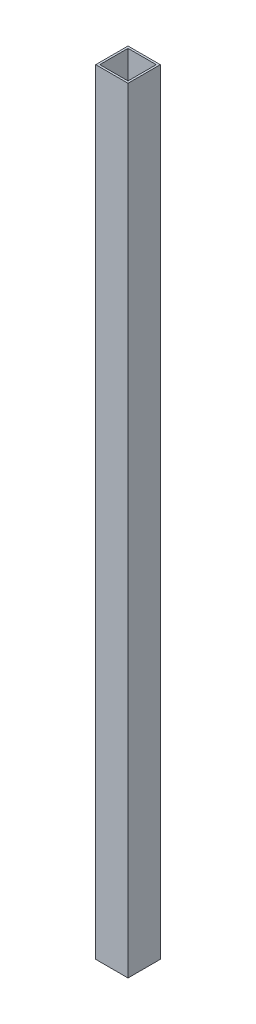
ISO-10303-21;
HEADER;
FILE_DESCRIPTION(('STEP AP214'),'2;1');
FILE_NAME('part.step','',(''),(''),'','','');
FILE_SCHEMA(('AUTOMOTIVE_DESIGN { 1 0 10303 214 1 1 1 1 }'));
ENDSEC;
DATA;
#1=APPLICATION_CONTEXT('core data for automotive mechanical design processes');
#2=APPLICATION_PROTOCOL_DEFINITION('international standard','automotive_design',2000,#1);
#3=PRODUCT_CONTEXT('',#1,'mechanical');
#4=PRODUCT('Part','Part','',(#3));
#5=PRODUCT_RELATED_PRODUCT_CATEGORY('part','',(#4));
#6=PRODUCT_DEFINITION_FORMATION('','',#4);
#7=PRODUCT_DEFINITION_CONTEXT('part definition',#1,'design');
#8=PRODUCT_DEFINITION('design','',#6,#7);
#9=PRODUCT_DEFINITION_SHAPE('','',#8);
#10=(LENGTH_UNIT() NAMED_UNIT(*) SI_UNIT(.MILLI.,.METRE.));
#11=(NAMED_UNIT(*) PLANE_ANGLE_UNIT() SI_UNIT($,.RADIAN.));
#12=(NAMED_UNIT(*) SI_UNIT($,.STERADIAN.) SOLID_ANGLE_UNIT());
#13=UNCERTAINTY_MEASURE_WITH_UNIT(LENGTH_MEASURE(1.E-05),#10,'distance_accuracy_value','');
#14=(GEOMETRIC_REPRESENTATION_CONTEXT(3) GLOBAL_UNCERTAINTY_ASSIGNED_CONTEXT((#13)) GLOBAL_UNIT_ASSIGNED_CONTEXT((#10,
#11,#12)) REPRESENTATION_CONTEXT('',''));
#15=CARTESIAN_POINT('',(0.,0.,0.));
#16=DIRECTION('',(0.,0.,1.));
#17=DIRECTION('',(1.,0.,0.));
#18=AXIS2_PLACEMENT_3D('',#15,#16,#17);
#19=CARTESIAN_POINT('',(0.,609.6,0.));
#20=DIRECTION('',(0.,-1.,0.));
#21=DIRECTION('',(0.,0.,-1.));
#22=AXIS2_PLACEMENT_3D('',#19,#20,#21);
#23=PLANE('',#22);
#24=DIRECTION('',(0.,0.,-1.));
#25=VECTOR('',#24,1.);
#26=CARTESIAN_POINT('',(12.7,609.6,12.7));
#27=LINE('',#26,#25);
#28=CARTESIAN_POINT('',(12.7,609.6,12.7));
#29=VERTEX_POINT('',#28);
#30=CARTESIAN_POINT('',(12.7,609.6,-12.7));
#31=VERTEX_POINT('',#30);
#32=EDGE_CURVE('E134',#29,#31,#27,.T.);
#33=ORIENTED_EDGE('',*,*,#32,.T.);
#34=DIRECTION('',(-1.,0.,0.));
#35=VECTOR('',#34,1.);
#36=CARTESIAN_POINT('',(-12.7,609.6,-12.7));
#37=LINE('',#36,#35);
#38=CARTESIAN_POINT('',(-12.7,609.6,-12.7));
#39=VERTEX_POINT('',#38);
#40=EDGE_CURVE('E137',#31,#39,#37,.T.);
#41=ORIENTED_EDGE('',*,*,#40,.T.);
#42=DIRECTION('',(0.,0.,1.));
#43=VECTOR('',#42,1.);
#44=CARTESIAN_POINT('',(-12.7,609.6,12.7));
#45=LINE('',#44,#43);
#46=CARTESIAN_POINT('',(-12.7,609.6,12.7));
#47=VERTEX_POINT('',#46);
#48=EDGE_CURVE('E140',#39,#47,#45,.T.);
#49=ORIENTED_EDGE('',*,*,#48,.T.);
#50=DIRECTION('',(1.,0.,0.));
#51=VECTOR('',#50,1.);
#52=CARTESIAN_POINT('',(-12.7,609.6,12.7));
#53=LINE('',#52,#51);
#54=EDGE_CURVE('E142',#47,#29,#53,.T.);
#55=ORIENTED_EDGE('',*,*,#54,.T.);
#56=EDGE_LOOP('',(#33,#41,#49,#55));
#57=FACE_BOUND('',#56,.T.);
#58=DIRECTION('',(0.,0.,-1.));
#59=VECTOR('',#58,1.);
#60=CARTESIAN_POINT('',(11.1125,609.6,11.1125));
#61=LINE('',#60,#59);
#62=CARTESIAN_POINT('',(11.1125,609.6,11.1125));
#63=VERTEX_POINT('',#62);
#64=CARTESIAN_POINT('',(11.1125,609.6,-11.1125));
#65=VERTEX_POINT('',#64);
#66=EDGE_CURVE('E98',#63,#65,#61,.T.);
#67=ORIENTED_EDGE('',*,*,#66,.F.);
#68=DIRECTION('',(1.,0.,0.));
#69=VECTOR('',#68,1.);
#70=CARTESIAN_POINT('',(-11.1125,609.6,11.1125));
#71=LINE('',#70,#69);
#72=CARTESIAN_POINT('',(-11.1125,609.6,11.1125));
#73=VERTEX_POINT('',#72);
#74=EDGE_CURVE('E120',#73,#63,#71,.T.);
#75=ORIENTED_EDGE('',*,*,#74,.F.);
#76=DIRECTION('',(0.,0.,1.));
#77=VECTOR('',#76,1.);
#78=CARTESIAN_POINT('',(-11.1125,609.6,11.1125));
#79=LINE('',#78,#77);
#80=CARTESIAN_POINT('',(-11.1125,609.6,-11.1125));
#81=VERTEX_POINT('',#80);
#82=EDGE_CURVE('E118',#81,#73,#79,.T.);
#83=ORIENTED_EDGE('',*,*,#82,.F.);
#84=DIRECTION('',(-1.,0.,0.));
#85=VECTOR('',#84,1.);
#86=CARTESIAN_POINT('',(-11.1125,609.6,-11.1125));
#87=LINE('',#86,#85);
#88=EDGE_CURVE('E106',#65,#81,#87,.T.);
#89=ORIENTED_EDGE('',*,*,#88,.F.);
#90=EDGE_LOOP('',(#67,#75,#83,#89));
#91=FACE_BOUND('',#90,.T.);
#92=ADVANCED_FACE('F33',(#57,#91),#23,.F.);
#93=CARTESIAN_POINT('',(0.,0.,0.));
#94=DIRECTION('',(0.,-1.,0.));
#95=DIRECTION('',(0.,0.,-1.));
#96=AXIS2_PLACEMENT_3D('',#93,#94,#95);
#97=PLANE('',#96);
#98=DIRECTION('',(0.,0.,-1.));
#99=VECTOR('',#98,1.);
#100=CARTESIAN_POINT('',(12.7,0.,12.7));
#101=LINE('',#100,#99);
#102=CARTESIAN_POINT('',(12.7,0.,12.7));
#103=VERTEX_POINT('',#102);
#104=CARTESIAN_POINT('',(12.7,0.,-12.7));
#105=VERTEX_POINT('',#104);
#106=EDGE_CURVE('E114',#103,#105,#101,.T.);
#107=ORIENTED_EDGE('',*,*,#106,.F.);
#108=DIRECTION('',(1.,0.,0.));
#109=VECTOR('',#108,1.);
#110=CARTESIAN_POINT('',(-12.7,0.,12.7));
#111=LINE('',#110,#109);
#112=CARTESIAN_POINT('',(-12.7,0.,12.7));
#113=VERTEX_POINT('',#112);
#114=EDGE_CURVE('E138',#113,#103,#111,.T.);
#115=ORIENTED_EDGE('',*,*,#114,.F.);
#116=DIRECTION('',(0.,0.,1.));
#117=VECTOR('',#116,1.);
#118=CARTESIAN_POINT('',(-12.7,0.,12.7));
#119=LINE('',#118,#117);
#120=CARTESIAN_POINT('',(-12.7,0.,-12.7));
#121=VERTEX_POINT('',#120);
#122=EDGE_CURVE('E149',#121,#113,#119,.T.);
#123=ORIENTED_EDGE('',*,*,#122,.F.);
#124=DIRECTION('',(-1.,0.,0.));
#125=VECTOR('',#124,1.);
#126=CARTESIAN_POINT('',(-12.7,0.,-12.7));
#127=LINE('',#126,#125);
#128=EDGE_CURVE('E147',#105,#121,#127,.T.);
#129=ORIENTED_EDGE('',*,*,#128,.F.);
#130=EDGE_LOOP('',(#107,#115,#123,#129));
#131=FACE_BOUND('',#130,.T.);
#132=DIRECTION('',(1.,0.,0.));
#133=VECTOR('',#132,1.);
#134=CARTESIAN_POINT('',(-11.1125,0.,11.1125));
#135=LINE('',#134,#133);
#136=CARTESIAN_POINT('',(-11.1125,0.,11.1125));
#137=VERTEX_POINT('',#136);
#138=CARTESIAN_POINT('',(11.1125,0.,11.1125));
#139=VERTEX_POINT('',#138);
#140=EDGE_CURVE('E107',#137,#139,#135,.T.);
#141=ORIENTED_EDGE('',*,*,#140,.T.);
#142=DIRECTION('',(0.,0.,-1.));
#143=VECTOR('',#142,1.);
#144=CARTESIAN_POINT('',(11.1125,0.,11.1125));
#145=LINE('',#144,#143);
#146=CARTESIAN_POINT('',(11.1125,0.,-11.1125));
#147=VERTEX_POINT('',#146);
#148=EDGE_CURVE('E56',#139,#147,#145,.T.);
#149=ORIENTED_EDGE('',*,*,#148,.T.);
#150=DIRECTION('',(-1.,0.,0.));
#151=VECTOR('',#150,1.);
#152=CARTESIAN_POINT('',(-11.1125,0.,-11.1125));
#153=LINE('',#152,#151);
#154=CARTESIAN_POINT('',(-11.1125,0.,-11.1125));
#155=VERTEX_POINT('',#154);
#156=EDGE_CURVE('E113',#147,#155,#153,.T.);
#157=ORIENTED_EDGE('',*,*,#156,.T.);
#158=DIRECTION('',(0.,0.,1.));
#159=VECTOR('',#158,1.);
#160=CARTESIAN_POINT('',(-11.1125,0.,11.1125));
#161=LINE('',#160,#159);
#162=EDGE_CURVE('E126',#155,#137,#161,.T.);
#163=ORIENTED_EDGE('',*,*,#162,.T.);
#164=EDGE_LOOP('',(#141,#149,#157,#163));
#165=FACE_BOUND('',#164,.T.);
#166=ADVANCED_FACE('F167',(#131,#165),#97,.T.);
#167=CARTESIAN_POINT('',(12.7,609.6,12.7));
#168=DIRECTION('',(-1.,0.,0.));
#169=DIRECTION('',(0.,0.,1.));
#170=AXIS2_PLACEMENT_3D('',#167,#168,#169);
#171=PLANE('',#170);
#172=ORIENTED_EDGE('',*,*,#106,.T.);
#173=DIRECTION('',(0.,-1.,0.));
#174=VECTOR('',#173,1.);
#175=CARTESIAN_POINT('',(12.7,609.6,-12.7));
#176=LINE('',#175,#174);
#177=EDGE_CURVE('E11',#31,#105,#176,.T.);
#178=ORIENTED_EDGE('',*,*,#177,.F.);
#179=ORIENTED_EDGE('',*,*,#32,.F.);
#180=DIRECTION('',(0.,-1.,0.));
#181=VECTOR('',#180,1.);
#182=CARTESIAN_POINT('',(12.7,609.6,12.7));
#183=LINE('',#182,#181);
#184=EDGE_CURVE('E144',#29,#103,#183,.T.);
#185=ORIENTED_EDGE('',*,*,#184,.T.);
#186=EDGE_LOOP('',(#172,#178,#179,#185));
#187=FACE_BOUND('',#186,.T.);
#188=ADVANCED_FACE('F35',(#187),#171,.F.);
#189=CARTESIAN_POINT('',(-12.7,609.6,-12.7));
#190=DIRECTION('',(0.,0.,1.));
#191=DIRECTION('',(1.,0.,0.));
#192=AXIS2_PLACEMENT_3D('',#189,#190,#191);
#193=PLANE('',#192);
#194=ORIENTED_EDGE('',*,*,#128,.T.);
#195=DIRECTION('',(0.,-1.,0.));
#196=VECTOR('',#195,1.);
#197=CARTESIAN_POINT('',(-12.7,609.6,-12.7));
#198=LINE('',#197,#196);
#199=EDGE_CURVE('E41',#39,#121,#198,.T.);
#200=ORIENTED_EDGE('',*,*,#199,.F.);
#201=ORIENTED_EDGE('',*,*,#40,.F.);
#202=ORIENTED_EDGE('',*,*,#177,.T.);
#203=EDGE_LOOP('',(#194,#200,#201,#202));
#204=FACE_BOUND('',#203,.T.);
#205=ADVANCED_FACE('F177',(#204),#193,.F.);
#206=CARTESIAN_POINT('',(-12.7,609.6,12.7));
#207=DIRECTION('',(1.,0.,0.));
#208=DIRECTION('',(0.,0.,-1.));
#209=AXIS2_PLACEMENT_3D('',#206,#207,#208);
#210=PLANE('',#209);
#211=ORIENTED_EDGE('',*,*,#122,.T.);
#212=DIRECTION('',(0.,-1.,0.));
#213=VECTOR('',#212,1.);
#214=CARTESIAN_POINT('',(-12.7,609.6,12.7));
#215=LINE('',#214,#213);
#216=EDGE_CURVE('E154',#47,#113,#215,.T.);
#217=ORIENTED_EDGE('',*,*,#216,.F.);
#218=ORIENTED_EDGE('',*,*,#48,.F.);
#219=ORIENTED_EDGE('',*,*,#199,.T.);
#220=EDGE_LOOP('',(#211,#217,#218,#219));
#221=FACE_BOUND('',#220,.T.);
#222=ADVANCED_FACE('F161',(#221),#210,.F.);
#223=CARTESIAN_POINT('',(-12.7,609.6,12.7));
#224=DIRECTION('',(0.,0.,-1.));
#225=DIRECTION('',(-1.,0.,0.));
#226=AXIS2_PLACEMENT_3D('',#223,#224,#225);
#227=PLANE('',#226);
#228=ORIENTED_EDGE('',*,*,#114,.T.);
#229=ORIENTED_EDGE('',*,*,#184,.F.);
#230=ORIENTED_EDGE('',*,*,#54,.F.);
#231=ORIENTED_EDGE('',*,*,#216,.T.);
#232=EDGE_LOOP('',(#228,#229,#230,#231));
#233=FACE_BOUND('',#232,.T.);
#234=ADVANCED_FACE('F171',(#233),#227,.F.);
#235=CARTESIAN_POINT('',(11.1125,609.6,11.1125));
#236=DIRECTION('',(-1.,0.,0.));
#237=DIRECTION('',(0.,0.,1.));
#238=AXIS2_PLACEMENT_3D('',#235,#236,#237);
#239=PLANE('',#238);
#240=ORIENTED_EDGE('',*,*,#148,.F.);
#241=DIRECTION('',(0.,-1.,0.));
#242=VECTOR('',#241,1.);
#243=CARTESIAN_POINT('',(11.1125,609.6,11.1125));
#244=LINE('',#243,#242);
#245=EDGE_CURVE('E102',#63,#139,#244,.T.);
#246=ORIENTED_EDGE('',*,*,#245,.F.);
#247=ORIENTED_EDGE('',*,*,#66,.T.);
#248=DIRECTION('',(0.,-1.,0.));
#249=VECTOR('',#248,1.);
#250=CARTESIAN_POINT('',(11.1125,609.6,-11.1125));
#251=LINE('',#250,#249);
#252=EDGE_CURVE('E101',#65,#147,#251,.T.);
#253=ORIENTED_EDGE('',*,*,#252,.T.);
#254=EDGE_LOOP('',(#240,#246,#247,#253));
#255=FACE_BOUND('',#254,.T.);
#256=ADVANCED_FACE('F100',(#255),#239,.T.);
#257=CARTESIAN_POINT('',(-11.1125,609.6,-11.1125));
#258=DIRECTION('',(0.,0.,1.));
#259=DIRECTION('',(1.,0.,0.));
#260=AXIS2_PLACEMENT_3D('',#257,#258,#259);
#261=PLANE('',#260);
#262=ORIENTED_EDGE('',*,*,#156,.F.);
#263=ORIENTED_EDGE('',*,*,#252,.F.);
#264=ORIENTED_EDGE('',*,*,#88,.T.);
#265=DIRECTION('',(0.,-1.,0.));
#266=VECTOR('',#265,1.);
#267=CARTESIAN_POINT('',(-11.1125,609.6,-11.1125));
#268=LINE('',#267,#266);
#269=EDGE_CURVE('E115',#81,#155,#268,.T.);
#270=ORIENTED_EDGE('',*,*,#269,.T.);
#271=EDGE_LOOP('',(#262,#263,#264,#270));
#272=FACE_BOUND('',#271,.T.);
#273=ADVANCED_FACE('F110',(#272),#261,.T.);
#274=CARTESIAN_POINT('',(-11.1125,609.6,11.1125));
#275=DIRECTION('',(1.,0.,0.));
#276=DIRECTION('',(0.,0.,-1.));
#277=AXIS2_PLACEMENT_3D('',#274,#275,#276);
#278=PLANE('',#277);
#279=ORIENTED_EDGE('',*,*,#162,.F.);
#280=ORIENTED_EDGE('',*,*,#269,.F.);
#281=ORIENTED_EDGE('',*,*,#82,.T.);
#282=DIRECTION('',(0.,-1.,0.));
#283=VECTOR('',#282,1.);
#284=CARTESIAN_POINT('',(-11.1125,609.6,11.1125));
#285=LINE('',#284,#283);
#286=EDGE_CURVE('E48',#73,#137,#285,.T.);
#287=ORIENTED_EDGE('',*,*,#286,.T.);
#288=EDGE_LOOP('',(#279,#280,#281,#287));
#289=FACE_BOUND('',#288,.T.);
#290=ADVANCED_FACE('F200',(#289),#278,.T.);
#291=CARTESIAN_POINT('',(-11.1125,609.6,11.1125));
#292=DIRECTION('',(0.,0.,-1.));
#293=DIRECTION('',(-1.,0.,0.));
#294=AXIS2_PLACEMENT_3D('',#291,#292,#293);
#295=PLANE('',#294);
#296=ORIENTED_EDGE('',*,*,#140,.F.);
#297=ORIENTED_EDGE('',*,*,#286,.F.);
#298=ORIENTED_EDGE('',*,*,#74,.T.);
#299=ORIENTED_EDGE('',*,*,#245,.T.);
#300=EDGE_LOOP('',(#296,#297,#298,#299));
#301=FACE_BOUND('',#300,.T.);
#302=ADVANCED_FACE('F204',(#301),#295,.T.);
#303=CLOSED_SHELL('',(#92,#166,#188,#205,#222,#234,#256,#273,#290,#302));
#304=MANIFOLD_SOLID_BREP('B2',#303);
#305=ADVANCED_BREP_SHAPE_REPRESENTATION('',(#18,#304),#14);
#306=SHAPE_DEFINITION_REPRESENTATION(#9,#305);
ENDSEC;
END-ISO-10303-21;
